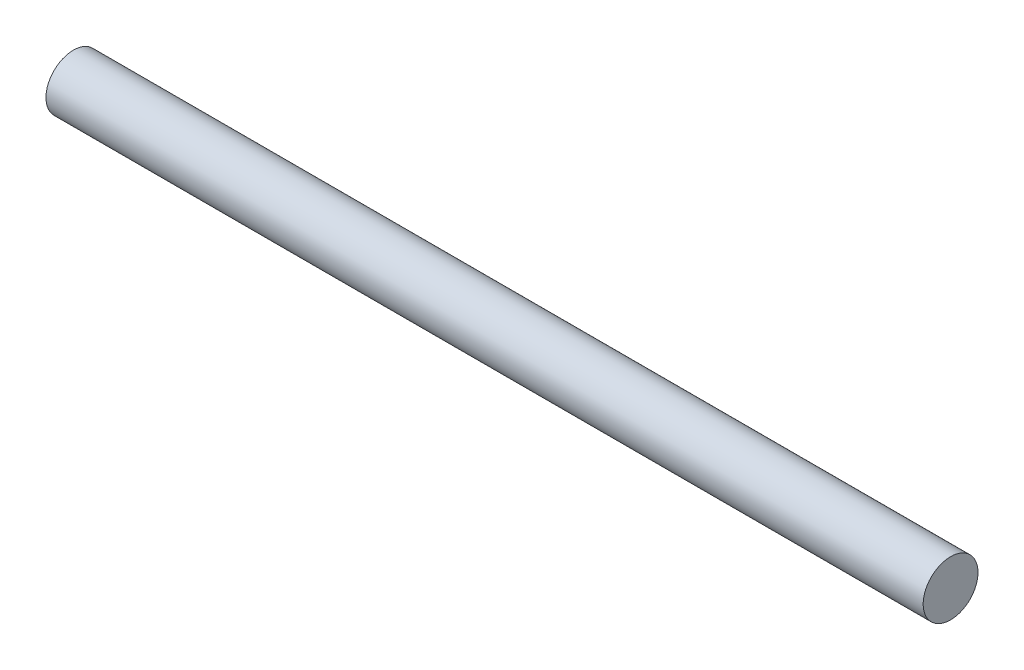
ISO-10303-21;
HEADER;
FILE_DESCRIPTION(('STEP AP214'),'2;1');
FILE_NAME('part.step','',(''),(''),'','','');
FILE_SCHEMA(('AUTOMOTIVE_DESIGN { 1 0 10303 214 1 1 1 1 }'));
ENDSEC;
DATA;
#1=APPLICATION_CONTEXT('core data for automotive mechanical design processes');
#2=APPLICATION_PROTOCOL_DEFINITION('international standard','automotive_design',2000,#1);
#3=PRODUCT_CONTEXT('',#1,'mechanical');
#4=PRODUCT('Part','Part','',(#3));
#5=PRODUCT_RELATED_PRODUCT_CATEGORY('part','',(#4));
#6=PRODUCT_DEFINITION_FORMATION('','',#4);
#7=PRODUCT_DEFINITION_CONTEXT('part definition',#1,'design');
#8=PRODUCT_DEFINITION('design','',#6,#7);
#9=PRODUCT_DEFINITION_SHAPE('','',#8);
#10=(LENGTH_UNIT() NAMED_UNIT(*) SI_UNIT(.MILLI.,.METRE.));
#11=(NAMED_UNIT(*) PLANE_ANGLE_UNIT() SI_UNIT($,.RADIAN.));
#12=(NAMED_UNIT(*) SI_UNIT($,.STERADIAN.) SOLID_ANGLE_UNIT());
#13=UNCERTAINTY_MEASURE_WITH_UNIT(LENGTH_MEASURE(1.E-05),#10,'distance_accuracy_value','');
#14=(GEOMETRIC_REPRESENTATION_CONTEXT(3) GLOBAL_UNCERTAINTY_ASSIGNED_CONTEXT((#13)) GLOBAL_UNIT_ASSIGNED_CONTEXT((#10,
#11,#12)) REPRESENTATION_CONTEXT('',''));
#15=CARTESIAN_POINT('',(0.,0.,0.));
#16=DIRECTION('',(0.,0.,1.));
#17=DIRECTION('',(1.,0.,0.));
#18=AXIS2_PLACEMENT_3D('',#15,#16,#17);
#19=CARTESIAN_POINT('',(8.,0.,0.));
#20=DIRECTION('',(-1.,0.,0.));
#21=DIRECTION('',(0.,0.,1.));
#22=AXIS2_PLACEMENT_3D('',#19,#20,#21);
#23=CYLINDRICAL_SURFACE('',#22,0.25);
#24=CARTESIAN_POINT('',(8.,0.,0.));
#25=DIRECTION('',(1.,0.,0.));
#26=DIRECTION('',(0.,0.,-1.));
#27=AXIS2_PLACEMENT_3D('',#24,#25,#26);
#28=CIRCLE('',#27,0.25);
#29=CARTESIAN_POINT('',(8.,0.,-0.25));
#30=VERTEX_POINT('',#29);
#31=EDGE_CURVE('E10',#30,#30,#28,.T.);
#32=ORIENTED_EDGE('',*,*,#31,.F.);
#33=EDGE_LOOP('',(#32));
#34=FACE_BOUND('',#33,.T.);
#35=CARTESIAN_POINT('',(0.,0.,0.));
#36=DIRECTION('',(1.,0.,0.));
#37=DIRECTION('',(0.,0.,-1.));
#38=AXIS2_PLACEMENT_3D('',#35,#36,#37);
#39=CIRCLE('',#38,0.25);
#40=CARTESIAN_POINT('',(0.,0.,-0.25));
#41=VERTEX_POINT('',#40);
#42=EDGE_CURVE('E40',#41,#41,#39,.T.);
#43=ORIENTED_EDGE('',*,*,#42,.T.);
#44=EDGE_LOOP('',(#43));
#45=FACE_BOUND('',#44,.T.);
#46=ADVANCED_FACE('F37',(#34,#45),#23,.T.);
#47=CARTESIAN_POINT('',(8.,0.,0.));
#48=DIRECTION('',(1.,0.,0.));
#49=DIRECTION('',(0.,0.,-1.));
#50=AXIS2_PLACEMENT_3D('',#47,#48,#49);
#51=PLANE('',#50);
#52=ORIENTED_EDGE('',*,*,#31,.T.);
#53=EDGE_LOOP('',(#52));
#54=FACE_BOUND('',#53,.T.);
#55=ADVANCED_FACE('F54',(#54),#51,.T.);
#56=CARTESIAN_POINT('',(0.,0.,0.));
#57=DIRECTION('',(1.,0.,0.));
#58=DIRECTION('',(0.,0.,-1.));
#59=AXIS2_PLACEMENT_3D('',#56,#57,#58);
#60=PLANE('',#59);
#61=ORIENTED_EDGE('',*,*,#42,.F.);
#62=EDGE_LOOP('',(#61));
#63=FACE_BOUND('',#62,.T.);
#64=ADVANCED_FACE('F52',(#63),#60,.F.);
#65=CLOSED_SHELL('',(#46,#55,#64));
#66=MANIFOLD_SOLID_BREP('B2',#65);
#67=ADVANCED_BREP_SHAPE_REPRESENTATION('',(#18,#66),#14);
#68=SHAPE_DEFINITION_REPRESENTATION(#9,#67);
ENDSEC;
END-ISO-10303-21;
